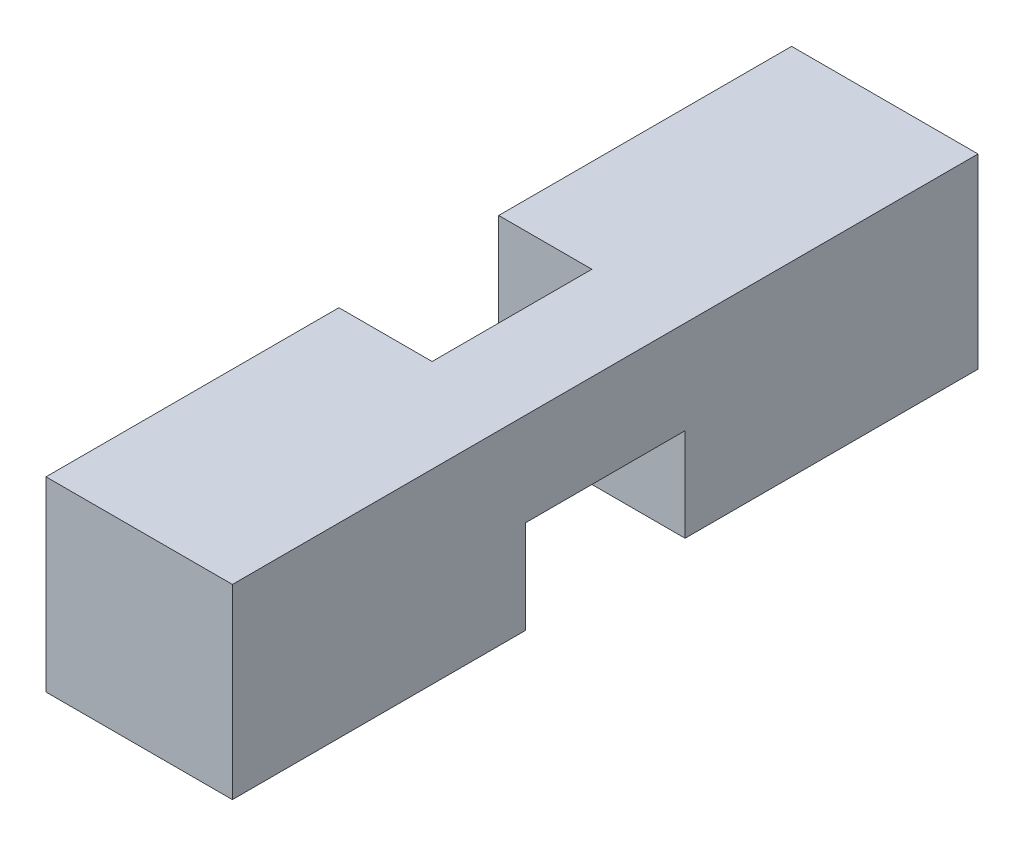
ISO-10303-21;
HEADER;
FILE_DESCRIPTION(('STEP AP214'),'2;1');
FILE_NAME('part.step','',(''),(''),'','','');
FILE_SCHEMA(('AUTOMOTIVE_DESIGN { 1 0 10303 214 1 1 1 1 }'));
ENDSEC;
DATA;
#1=APPLICATION_CONTEXT('core data for automotive mechanical design processes');
#2=APPLICATION_PROTOCOL_DEFINITION('international standard','automotive_design',2000,#1);
#3=PRODUCT_CONTEXT('',#1,'mechanical');
#4=PRODUCT('Part','Part','',(#3));
#5=PRODUCT_RELATED_PRODUCT_CATEGORY('part','',(#4));
#6=PRODUCT_DEFINITION_FORMATION('','',#4);
#7=PRODUCT_DEFINITION_CONTEXT('part definition',#1,'design');
#8=PRODUCT_DEFINITION('design','',#6,#7);
#9=PRODUCT_DEFINITION_SHAPE('','',#8);
#10=(LENGTH_UNIT() NAMED_UNIT(*) SI_UNIT(.MILLI.,.METRE.));
#11=(NAMED_UNIT(*) PLANE_ANGLE_UNIT() SI_UNIT($,.RADIAN.));
#12=(NAMED_UNIT(*) SI_UNIT($,.STERADIAN.) SOLID_ANGLE_UNIT());
#13=UNCERTAINTY_MEASURE_WITH_UNIT(LENGTH_MEASURE(1.E-05),#10,'distance_accuracy_value','');
#14=(GEOMETRIC_REPRESENTATION_CONTEXT(3) GLOBAL_UNCERTAINTY_ASSIGNED_CONTEXT((#13)) GLOBAL_UNIT_ASSIGNED_CONTEXT((#10,
#11,#12)) REPRESENTATION_CONTEXT('',''));
#15=CARTESIAN_POINT('',(0.,0.,0.));
#16=DIRECTION('',(0.,0.,1.));
#17=DIRECTION('',(1.,0.,0.));
#18=AXIS2_PLACEMENT_3D('',#15,#16,#17);
#19=CARTESIAN_POINT('',(-1.75,1.75,14.));
#20=DIRECTION('',(1.,0.,0.));
#21=DIRECTION('',(0.,0.,-1.));
#22=AXIS2_PLACEMENT_3D('',#19,#20,#21);
#23=PLANE('',#22);
#24=DIRECTION('',(0.,-1.,0.));
#25=VECTOR('',#24,1.);
#26=CARTESIAN_POINT('',(-1.75,1.75,5.5));
#27=LINE('',#26,#25);
#28=CARTESIAN_POINT('',(-1.75,1.75,5.5));
#29=VERTEX_POINT('',#28);
#30=CARTESIAN_POINT('',(-1.75,-1.75,5.5));
#31=VERTEX_POINT('',#30);
#32=EDGE_CURVE('E55',#29,#31,#27,.T.);
#33=ORIENTED_EDGE('',*,*,#32,.F.);
#34=DIRECTION('',(0.,0.,-1.));
#35=VECTOR('',#34,1.);
#36=CARTESIAN_POINT('',(-1.75,1.75,14.));
#37=LINE('',#36,#35);
#38=CARTESIAN_POINT('',(-1.75,1.75,0.));
#39=VERTEX_POINT('',#38);
#40=EDGE_CURVE('E143',#29,#39,#37,.T.);
#41=ORIENTED_EDGE('',*,*,#40,.T.);
#42=DIRECTION('',(0.,-1.,0.));
#43=VECTOR('',#42,1.);
#44=CARTESIAN_POINT('',(-1.75,1.75,0.));
#45=LINE('',#44,#43);
#46=CARTESIAN_POINT('',(-1.75,-1.75,0.));
#47=VERTEX_POINT('',#46);
#48=EDGE_CURVE('E189',#39,#47,#45,.T.);
#49=ORIENTED_EDGE('',*,*,#48,.T.);
#50=DIRECTION('',(0.,0.,-1.));
#51=VECTOR('',#50,1.);
#52=CARTESIAN_POINT('',(-1.75,-1.75,14.));
#53=LINE('',#52,#51);
#54=EDGE_CURVE('E199',#31,#47,#53,.T.);
#55=ORIENTED_EDGE('',*,*,#54,.F.);
#56=EDGE_LOOP('',(#33,#41,#49,#55));
#57=FACE_BOUND('',#56,.T.);
#58=ADVANCED_FACE('F39',(#57),#23,.F.);
#59=CARTESIAN_POINT('',(-1.75,-1.75,14.));
#60=DIRECTION('',(0.,1.,0.));
#61=DIRECTION('',(0.,0.,1.));
#62=AXIS2_PLACEMENT_3D('',#59,#60,#61);
#63=PLANE('',#62);
#64=DIRECTION('',(1.,0.,0.));
#65=VECTOR('',#64,1.);
#66=CARTESIAN_POINT('',(-1.75,-1.75,5.5));
#67=LINE('',#66,#65);
#68=CARTESIAN_POINT('',(1.75,-1.75,5.5));
#69=VERTEX_POINT('',#68);
#70=EDGE_CURVE('E147',#31,#69,#67,.T.);
#71=ORIENTED_EDGE('',*,*,#70,.F.);
#72=ORIENTED_EDGE('',*,*,#54,.T.);
#73=DIRECTION('',(1.,0.,0.));
#74=VECTOR('',#73,1.);
#75=CARTESIAN_POINT('',(-1.75,-1.75,0.));
#76=LINE('',#75,#74);
#77=CARTESIAN_POINT('',(1.75,-1.75,0.));
#78=VERTEX_POINT('',#77);
#79=EDGE_CURVE('E176',#47,#78,#76,.T.);
#80=ORIENTED_EDGE('',*,*,#79,.T.);
#81=DIRECTION('',(0.,0.,-1.));
#82=VECTOR('',#81,1.);
#83=CARTESIAN_POINT('',(1.75,-1.75,14.));
#84=LINE('',#83,#82);
#85=EDGE_CURVE('E86',#69,#78,#84,.T.);
#86=ORIENTED_EDGE('',*,*,#85,.F.);
#87=EDGE_LOOP('',(#71,#72,#80,#86));
#88=FACE_BOUND('',#87,.T.);
#89=ADVANCED_FACE('F217',(#88),#63,.F.);
#90=CARTESIAN_POINT('',(1.75,1.75,14.));
#91=DIRECTION('',(-1.,0.,0.));
#92=DIRECTION('',(0.,0.,1.));
#93=AXIS2_PLACEMENT_3D('',#90,#91,#92);
#94=PLANE('',#93);
#95=CARTESIAN_POINT('',(1.75,-1.75,14.));
#96=VERTEX_POINT('',#95);
#97=CARTESIAN_POINT('',(1.75,-1.75,8.5));
#98=VERTEX_POINT('',#97);
#99=EDGE_CURVE('E195',#96,#98,#84,.T.);
#100=ORIENTED_EDGE('',*,*,#99,.T.);
#101=DIRECTION('',(0.,1.,0.));
#102=VECTOR('',#101,1.);
#103=CARTESIAN_POINT('',(1.75,-1.75,8.5));
#104=LINE('',#103,#102);
#105=CARTESIAN_POINT('',(1.75,0.,8.5));
#106=VERTEX_POINT('',#105);
#107=EDGE_CURVE('E167',#98,#106,#104,.T.);
#108=ORIENTED_EDGE('',*,*,#107,.T.);
#109=DIRECTION('',(0.,0.,-1.));
#110=VECTOR('',#109,1.);
#111=CARTESIAN_POINT('',(1.75,0.,8.5));
#112=LINE('',#111,#110);
#113=CARTESIAN_POINT('',(1.75,0.,5.5));
#114=VERTEX_POINT('',#113);
#115=EDGE_CURVE('E132',#106,#114,#112,.T.);
#116=ORIENTED_EDGE('',*,*,#115,.T.);
#117=DIRECTION('',(0.,1.,0.));
#118=VECTOR('',#117,1.);
#119=CARTESIAN_POINT('',(1.75,-1.75,5.5));
#120=LINE('',#119,#118);
#121=EDGE_CURVE('E136',#69,#114,#120,.T.);
#122=ORIENTED_EDGE('',*,*,#121,.F.);
#123=ORIENTED_EDGE('',*,*,#85,.T.);
#124=DIRECTION('',(0.,1.,0.));
#125=VECTOR('',#124,1.);
#126=CARTESIAN_POINT('',(1.75,1.75,0.));
#127=LINE('',#126,#125);
#128=CARTESIAN_POINT('',(1.75,1.75,0.));
#129=VERTEX_POINT('',#128);
#130=EDGE_CURVE('E131',#78,#129,#127,.T.);
#131=ORIENTED_EDGE('',*,*,#130,.T.);
#132=DIRECTION('',(0.,0.,-1.));
#133=VECTOR('',#132,1.);
#134=CARTESIAN_POINT('',(1.75,1.75,14.));
#135=LINE('',#134,#133);
#136=CARTESIAN_POINT('',(1.75,1.75,14.));
#137=VERTEX_POINT('',#136);
#138=EDGE_CURVE('E11',#137,#129,#135,.T.);
#139=ORIENTED_EDGE('',*,*,#138,.F.);
#140=DIRECTION('',(0.,1.,0.));
#141=VECTOR('',#140,1.);
#142=CARTESIAN_POINT('',(1.75,1.75,14.));
#143=LINE('',#142,#141);
#144=EDGE_CURVE('E173',#96,#137,#143,.T.);
#145=ORIENTED_EDGE('',*,*,#144,.F.);
#146=EDGE_LOOP('',(#100,#108,#116,#122,#123,#131,#139,#145));
#147=FACE_BOUND('',#146,.T.);
#148=ADVANCED_FACE('F41',(#147),#94,.F.);
#149=CARTESIAN_POINT('',(-1.75,1.75,14.));
#150=DIRECTION('',(0.,-1.,0.));
#151=DIRECTION('',(0.,0.,-1.));
#152=AXIS2_PLACEMENT_3D('',#149,#150,#151);
#153=PLANE('',#152);
#154=DIRECTION('',(0.,0.,-1.));
#155=VECTOR('',#154,1.);
#156=CARTESIAN_POINT('',(0.,1.75,8.5));
#157=LINE('',#156,#155);
#158=CARTESIAN_POINT('',(0.,1.75,8.5));
#159=VERTEX_POINT('',#158);
#160=CARTESIAN_POINT('',(0.,1.75,5.5));
#161=VERTEX_POINT('',#160);
#162=EDGE_CURVE('E121',#159,#161,#157,.T.);
#163=ORIENTED_EDGE('',*,*,#162,.F.);
#164=DIRECTION('',(-1.,0.,0.));
#165=VECTOR('',#164,1.);
#166=CARTESIAN_POINT('',(0.,1.75,8.5));
#167=LINE('',#166,#165);
#168=CARTESIAN_POINT('',(-1.75,1.75,8.5));
#169=VERTEX_POINT('',#168);
#170=EDGE_CURVE('E156',#159,#169,#167,.T.);
#171=ORIENTED_EDGE('',*,*,#170,.T.);
#172=CARTESIAN_POINT('',(-1.75,1.75,14.));
#173=VERTEX_POINT('',#172);
#174=EDGE_CURVE('E48',#173,#169,#37,.T.);
#175=ORIENTED_EDGE('',*,*,#174,.F.);
#176=DIRECTION('',(-1.,0.,0.));
#177=VECTOR('',#176,1.);
#178=CARTESIAN_POINT('',(-1.75,1.75,14.));
#179=LINE('',#178,#177);
#180=EDGE_CURVE('E93',#137,#173,#179,.T.);
#181=ORIENTED_EDGE('',*,*,#180,.F.);
#182=ORIENTED_EDGE('',*,*,#138,.T.);
#183=DIRECTION('',(-1.,0.,0.));
#184=VECTOR('',#183,1.);
#185=CARTESIAN_POINT('',(-1.75,1.75,0.));
#186=LINE('',#185,#184);
#187=EDGE_CURVE('E186',#129,#39,#186,.T.);
#188=ORIENTED_EDGE('',*,*,#187,.T.);
#189=ORIENTED_EDGE('',*,*,#40,.F.);
#190=DIRECTION('',(-1.,0.,0.));
#191=VECTOR('',#190,1.);
#192=CARTESIAN_POINT('',(0.,1.75,5.5));
#193=LINE('',#192,#191);
#194=EDGE_CURVE('E135',#161,#29,#193,.T.);
#195=ORIENTED_EDGE('',*,*,#194,.F.);
#196=EDGE_LOOP('',(#163,#171,#175,#181,#182,#188,#189,#195));
#197=FACE_BOUND('',#196,.T.);
#198=ADVANCED_FACE('F141',(#197),#153,.F.);
#199=ORIENTED_EDGE('',*,*,#174,.T.);
#200=DIRECTION('',(0.,-1.,0.));
#201=VECTOR('',#200,1.);
#202=CARTESIAN_POINT('',(-1.75,1.75,8.5));
#203=LINE('',#202,#201);
#204=CARTESIAN_POINT('',(-1.75,-1.75,8.5));
#205=VERTEX_POINT('',#204);
#206=EDGE_CURVE('E159',#169,#205,#203,.T.);
#207=ORIENTED_EDGE('',*,*,#206,.T.);
#208=CARTESIAN_POINT('',(-1.75,-1.75,14.));
#209=VERTEX_POINT('',#208);
#210=EDGE_CURVE('E200',#209,#205,#53,.T.);
#211=ORIENTED_EDGE('',*,*,#210,.F.);
#212=DIRECTION('',(0.,-1.,0.));
#213=VECTOR('',#212,1.);
#214=CARTESIAN_POINT('',(-1.75,1.75,14.));
#215=LINE('',#214,#213);
#216=EDGE_CURVE('E179',#173,#209,#215,.T.);
#217=ORIENTED_EDGE('',*,*,#216,.F.);
#218=EDGE_LOOP('',(#199,#207,#211,#217));
#219=FACE_BOUND('',#218,.T.);
#220=ADVANCED_FACE('F223',(#219),#23,.F.);
#221=ORIENTED_EDGE('',*,*,#210,.T.);
#222=DIRECTION('',(1.,0.,0.));
#223=VECTOR('',#222,1.);
#224=CARTESIAN_POINT('',(-1.75,-1.75,8.5));
#225=LINE('',#224,#223);
#226=EDGE_CURVE('E163',#205,#98,#225,.T.);
#227=ORIENTED_EDGE('',*,*,#226,.T.);
#228=ORIENTED_EDGE('',*,*,#99,.F.);
#229=DIRECTION('',(1.,0.,0.));
#230=VECTOR('',#229,1.);
#231=CARTESIAN_POINT('',(-1.75,-1.75,14.));
#232=LINE('',#231,#230);
#233=EDGE_CURVE('E64',#209,#96,#232,.T.);
#234=ORIENTED_EDGE('',*,*,#233,.F.);
#235=EDGE_LOOP('',(#221,#227,#228,#234));
#236=FACE_BOUND('',#235,.T.);
#237=ADVANCED_FACE('F227',(#236),#63,.F.);
#238=CARTESIAN_POINT('',(0.,0.,14.));
#239=DIRECTION('',(0.,0.,1.));
#240=DIRECTION('',(1.,0.,0.));
#241=AXIS2_PLACEMENT_3D('',#238,#239,#240);
#242=PLANE('',#241);
#243=ORIENTED_EDGE('',*,*,#144,.T.);
#244=ORIENTED_EDGE('',*,*,#180,.T.);
#245=ORIENTED_EDGE('',*,*,#216,.T.);
#246=ORIENTED_EDGE('',*,*,#233,.T.);
#247=EDGE_LOOP('',(#243,#244,#245,#246));
#248=FACE_BOUND('',#247,.T.);
#249=ADVANCED_FACE('F224',(#248),#242,.T.);
#250=CARTESIAN_POINT('',(0.,0.,0.));
#251=DIRECTION('',(0.,0.,1.));
#252=DIRECTION('',(1.,0.,0.));
#253=AXIS2_PLACEMENT_3D('',#250,#251,#252);
#254=PLANE('',#253);
#255=ORIENTED_EDGE('',*,*,#130,.F.);
#256=ORIENTED_EDGE('',*,*,#79,.F.);
#257=ORIENTED_EDGE('',*,*,#48,.F.);
#258=ORIENTED_EDGE('',*,*,#187,.F.);
#259=EDGE_LOOP('',(#255,#256,#257,#258));
#260=FACE_BOUND('',#259,.T.);
#261=ADVANCED_FACE('F215',(#260),#254,.F.);
#262=CARTESIAN_POINT('',(1.75,1.75,8.5));
#263=DIRECTION('',(0.,0.,-1.));
#264=DIRECTION('',(-1.,0.,0.));
#265=AXIS2_PLACEMENT_3D('',#262,#263,#264);
#266=CYLINDRICAL_SURFACE('',#265,1.75);
#267=ORIENTED_EDGE('',*,*,#115,.F.);
#268=CARTESIAN_POINT('',(1.75,1.75,8.5));
#269=DIRECTION('',(0.,0.,-1.));
#270=DIRECTION('',(1.,0.,0.));
#271=AXIS2_PLACEMENT_3D('',#268,#269,#270);
#272=CIRCLE('',#271,1.75);
#273=EDGE_CURVE('E127',#106,#159,#272,.T.);
#274=ORIENTED_EDGE('',*,*,#273,.T.);
#275=ORIENTED_EDGE('',*,*,#162,.T.);
#276=CARTESIAN_POINT('',(1.75,1.75,5.5));
#277=DIRECTION('',(0.,0.,-1.));
#278=DIRECTION('',(1.,0.,0.));
#279=AXIS2_PLACEMENT_3D('',#276,#277,#278);
#280=CIRCLE('',#279,1.75);
#281=EDGE_CURVE('E124',#114,#161,#280,.T.);
#282=ORIENTED_EDGE('',*,*,#281,.F.);
#283=EDGE_LOOP('',(#267,#274,#275,#282));
#284=FACE_BOUND('',#283,.T.);
#285=ADVANCED_FACE('F123',(#284),#266,.T.);
#286=CARTESIAN_POINT('',(1.75,1.75,8.5));
#287=DIRECTION('',(0.,0.,1.));
#288=DIRECTION('',(1.,0.,0.));
#289=AXIS2_PLACEMENT_3D('',#286,#287,#288);
#290=PLANE('',#289);
#291=ORIENTED_EDGE('',*,*,#273,.F.);
#292=ORIENTED_EDGE('',*,*,#107,.F.);
#293=ORIENTED_EDGE('',*,*,#226,.F.);
#294=ORIENTED_EDGE('',*,*,#206,.F.);
#295=ORIENTED_EDGE('',*,*,#170,.F.);
#296=EDGE_LOOP('',(#291,#292,#293,#294,#295));
#297=FACE_BOUND('',#296,.T.);
#298=ADVANCED_FACE('F221',(#297),#290,.F.);
#299=CARTESIAN_POINT('',(1.75,1.75,5.5));
#300=DIRECTION('',(0.,0.,1.));
#301=DIRECTION('',(1.,0.,0.));
#302=AXIS2_PLACEMENT_3D('',#299,#300,#301);
#303=PLANE('',#302);
#304=ORIENTED_EDGE('',*,*,#281,.T.);
#305=ORIENTED_EDGE('',*,*,#194,.T.);
#306=ORIENTED_EDGE('',*,*,#32,.T.);
#307=ORIENTED_EDGE('',*,*,#70,.T.);
#308=ORIENTED_EDGE('',*,*,#121,.T.);
#309=EDGE_LOOP('',(#304,#305,#306,#307,#308));
#310=FACE_BOUND('',#309,.T.);
#311=ADVANCED_FACE('F134',(#310),#303,.T.);
#312=CLOSED_SHELL('',(#58,#89,#148,#198,#220,#237,#249,#261,#285,#298,#311));
#313=MANIFOLD_SOLID_BREP('B2',#312);
#314=ADVANCED_BREP_SHAPE_REPRESENTATION('',(#18,#313),#14);
#315=SHAPE_DEFINITION_REPRESENTATION(#9,#314);
ENDSEC;
END-ISO-10303-21;
